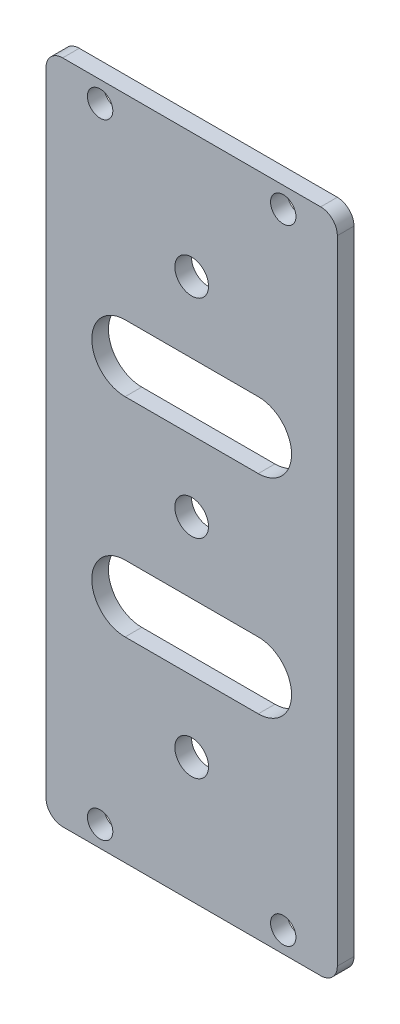
ISO-10303-21;
HEADER;
FILE_DESCRIPTION(('STEP AP214'),'2;1');
FILE_NAME('part.step','',(''),(''),'','','');
FILE_SCHEMA(('AUTOMOTIVE_DESIGN { 1 0 10303 214 1 1 1 1 }'));
ENDSEC;
DATA;
#1=APPLICATION_CONTEXT('core data for automotive mechanical design processes');
#2=APPLICATION_PROTOCOL_DEFINITION('international standard','automotive_design',2000,#1);
#3=PRODUCT_CONTEXT('',#1,'mechanical');
#4=PRODUCT('Part','Part','',(#3));
#5=PRODUCT_RELATED_PRODUCT_CATEGORY('part','',(#4));
#6=PRODUCT_DEFINITION_FORMATION('','',#4);
#7=PRODUCT_DEFINITION_CONTEXT('part definition',#1,'design');
#8=PRODUCT_DEFINITION('design','',#6,#7);
#9=PRODUCT_DEFINITION_SHAPE('','',#8);
#10=(LENGTH_UNIT() NAMED_UNIT(*) SI_UNIT(.MILLI.,.METRE.));
#11=(NAMED_UNIT(*) PLANE_ANGLE_UNIT() SI_UNIT($,.RADIAN.));
#12=(NAMED_UNIT(*) SI_UNIT($,.STERADIAN.) SOLID_ANGLE_UNIT());
#13=UNCERTAINTY_MEASURE_WITH_UNIT(LENGTH_MEASURE(1.E-05),#10,'distance_accuracy_value','');
#14=(GEOMETRIC_REPRESENTATION_CONTEXT(3) GLOBAL_UNCERTAINTY_ASSIGNED_CONTEXT((#13)) GLOBAL_UNIT_ASSIGNED_CONTEXT((#10,
#11,#12)) REPRESENTATION_CONTEXT('',''));
#15=CARTESIAN_POINT('',(0.,0.,0.));
#16=DIRECTION('',(0.,0.,1.));
#17=DIRECTION('',(1.,0.,0.));
#18=AXIS2_PLACEMENT_3D('',#15,#16,#17);
#19=CARTESIAN_POINT('',(17.5,-40.,2.));
#20=DIRECTION('',(-1.,0.,0.));
#21=DIRECTION('',(0.,0.,1.));
#22=AXIS2_PLACEMENT_3D('',#19,#20,#21);
#23=PLANE('',#22);
#24=DIRECTION('',(0.,1.,0.));
#25=VECTOR('',#24,1.);
#26=CARTESIAN_POINT('',(17.5,-40.,2.));
#27=LINE('',#26,#25);
#28=CARTESIAN_POINT('',(17.5,-38.,2.));
#29=VERTEX_POINT('',#28);
#30=CARTESIAN_POINT('',(17.5,38.,2.));
#31=VERTEX_POINT('',#30);
#32=EDGE_CURVE('E256',#29,#31,#27,.T.);
#33=ORIENTED_EDGE('',*,*,#32,.F.);
#34=DIRECTION('',(0.,0.,-1.));
#35=VECTOR('',#34,1.);
#36=CARTESIAN_POINT('',(17.5,-38.,2.));
#37=LINE('',#36,#35);
#38=CARTESIAN_POINT('',(17.5,-38.,0.));
#39=VERTEX_POINT('',#38);
#40=EDGE_CURVE('E281',#29,#39,#37,.T.);
#41=ORIENTED_EDGE('',*,*,#40,.T.);
#42=DIRECTION('',(0.,1.,0.));
#43=VECTOR('',#42,1.);
#44=CARTESIAN_POINT('',(17.5,-40.,0.));
#45=LINE('',#44,#43);
#46=CARTESIAN_POINT('',(17.5,38.,0.));
#47=VERTEX_POINT('',#46);
#48=EDGE_CURVE('E253',#39,#47,#45,.T.);
#49=ORIENTED_EDGE('',*,*,#48,.T.);
#50=DIRECTION('',(0.,0.,-1.));
#51=VECTOR('',#50,1.);
#52=CARTESIAN_POINT('',(17.5,38.,2.));
#53=LINE('',#52,#51);
#54=EDGE_CURVE('E269',#47,#31,#53,.F.);
#55=ORIENTED_EDGE('',*,*,#54,.T.);
#56=EDGE_LOOP('',(#33,#41,#49,#55));
#57=FACE_BOUND('',#56,.T.);
#58=ADVANCED_FACE('F37',(#57),#23,.F.);
#59=CARTESIAN_POINT('',(-17.5,40.,2.));
#60=DIRECTION('',(0.,-1.,0.));
#61=DIRECTION('',(0.,0.,-1.));
#62=AXIS2_PLACEMENT_3D('',#59,#60,#61);
#63=PLANE('',#62);
#64=DIRECTION('',(-1.,0.,0.));
#65=VECTOR('',#64,1.);
#66=CARTESIAN_POINT('',(-17.5,40.,2.));
#67=LINE('',#66,#65);
#68=CARTESIAN_POINT('',(15.5,40.,2.));
#69=VERTEX_POINT('',#68);
#70=CARTESIAN_POINT('',(-15.5,40.,2.));
#71=VERTEX_POINT('',#70);
#72=EDGE_CURVE('E259',#69,#71,#67,.T.);
#73=ORIENTED_EDGE('',*,*,#72,.F.);
#74=DIRECTION('',(0.,0.,-1.));
#75=VECTOR('',#74,1.);
#76=CARTESIAN_POINT('',(15.5,40.,2.));
#77=LINE('',#76,#75);
#78=CARTESIAN_POINT('',(15.5,40.,0.));
#79=VERTEX_POINT('',#78);
#80=EDGE_CURVE('E11',#69,#79,#77,.T.);
#81=ORIENTED_EDGE('',*,*,#80,.T.);
#82=DIRECTION('',(-1.,0.,0.));
#83=VECTOR('',#82,1.);
#84=CARTESIAN_POINT('',(-17.5,40.,0.));
#85=LINE('',#84,#83);
#86=CARTESIAN_POINT('',(-15.5,40.,0.));
#87=VERTEX_POINT('',#86);
#88=EDGE_CURVE('E272',#79,#87,#85,.T.);
#89=ORIENTED_EDGE('',*,*,#88,.T.);
#90=DIRECTION('',(0.,0.,-1.));
#91=VECTOR('',#90,1.);
#92=CARTESIAN_POINT('',(-15.5,40.,2.));
#93=LINE('',#92,#91);
#94=EDGE_CURVE('E46',#87,#71,#93,.F.);
#95=ORIENTED_EDGE('',*,*,#94,.T.);
#96=EDGE_LOOP('',(#73,#81,#89,#95));
#97=FACE_BOUND('',#96,.T.);
#98=ADVANCED_FACE('F353',(#97),#63,.F.);
#99=CARTESIAN_POINT('',(-17.5,-40.,2.));
#100=DIRECTION('',(1.,0.,0.));
#101=DIRECTION('',(0.,0.,-1.));
#102=AXIS2_PLACEMENT_3D('',#99,#100,#101);
#103=PLANE('',#102);
#104=DIRECTION('',(0.,-1.,0.));
#105=VECTOR('',#104,1.);
#106=CARTESIAN_POINT('',(-17.5,-40.,0.));
#107=LINE('',#106,#105);
#108=CARTESIAN_POINT('',(-17.5,38.,0.));
#109=VERTEX_POINT('',#108);
#110=CARTESIAN_POINT('',(-17.5,-38.,0.));
#111=VERTEX_POINT('',#110);
#112=EDGE_CURVE('E275',#109,#111,#107,.T.);
#113=ORIENTED_EDGE('',*,*,#112,.T.);
#114=DIRECTION('',(0.,0.,-1.));
#115=VECTOR('',#114,1.);
#116=CARTESIAN_POINT('',(-17.5,-38.,2.));
#117=LINE('',#116,#115);
#118=CARTESIAN_POINT('',(-17.5,-38.,2.));
#119=VERTEX_POINT('',#118);
#120=EDGE_CURVE('E308',#111,#119,#117,.F.);
#121=ORIENTED_EDGE('',*,*,#120,.T.);
#122=DIRECTION('',(0.,-1.,0.));
#123=VECTOR('',#122,1.);
#124=CARTESIAN_POINT('',(-17.5,-40.,2.));
#125=LINE('',#124,#123);
#126=CARTESIAN_POINT('',(-17.5,38.,2.));
#127=VERTEX_POINT('',#126);
#128=EDGE_CURVE('E263',#127,#119,#125,.T.);
#129=ORIENTED_EDGE('',*,*,#128,.F.);
#130=DIRECTION('',(0.,0.,-1.));
#131=VECTOR('',#130,1.);
#132=CARTESIAN_POINT('',(-17.5,38.,2.));
#133=LINE('',#132,#131);
#134=EDGE_CURVE('E305',#127,#109,#133,.T.);
#135=ORIENTED_EDGE('',*,*,#134,.T.);
#136=EDGE_LOOP('',(#113,#121,#129,#135));
#137=FACE_BOUND('',#136,.T.);
#138=ADVANCED_FACE('F360',(#137),#103,.F.);
#139=CARTESIAN_POINT('',(-17.5,-40.,2.));
#140=DIRECTION('',(0.,1.,0.));
#141=DIRECTION('',(0.,0.,1.));
#142=AXIS2_PLACEMENT_3D('',#139,#140,#141);
#143=PLANE('',#142);
#144=DIRECTION('',(1.,0.,0.));
#145=VECTOR('',#144,1.);
#146=CARTESIAN_POINT('',(-17.5,-40.,0.));
#147=LINE('',#146,#145);
#148=CARTESIAN_POINT('',(-15.5,-40.,0.));
#149=VERTEX_POINT('',#148);
#150=CARTESIAN_POINT('',(15.5,-40.,0.));
#151=VERTEX_POINT('',#150);
#152=EDGE_CURVE('E260',#149,#151,#147,.T.);
#153=ORIENTED_EDGE('',*,*,#152,.T.);
#154=DIRECTION('',(0.,0.,-1.));
#155=VECTOR('',#154,1.);
#156=CARTESIAN_POINT('',(15.5,-40.,2.));
#157=LINE('',#156,#155);
#158=CARTESIAN_POINT('',(15.5,-40.,2.));
#159=VERTEX_POINT('',#158);
#160=EDGE_CURVE('E295',#151,#159,#157,.F.);
#161=ORIENTED_EDGE('',*,*,#160,.T.);
#162=DIRECTION('',(1.,0.,0.));
#163=VECTOR('',#162,1.);
#164=CARTESIAN_POINT('',(-17.5,-40.,2.));
#165=LINE('',#164,#163);
#166=CARTESIAN_POINT('',(-15.5,-40.,2.));
#167=VERTEX_POINT('',#166);
#168=EDGE_CURVE('E266',#167,#159,#165,.T.);
#169=ORIENTED_EDGE('',*,*,#168,.F.);
#170=DIRECTION('',(0.,0.,-1.));
#171=VECTOR('',#170,1.);
#172=CARTESIAN_POINT('',(-15.5,-40.,2.));
#173=LINE('',#172,#171);
#174=EDGE_CURVE('E292',#167,#149,#173,.T.);
#175=ORIENTED_EDGE('',*,*,#174,.T.);
#176=EDGE_LOOP('',(#153,#161,#169,#175));
#177=FACE_BOUND('',#176,.T.);
#178=ADVANCED_FACE('F369',(#177),#143,.F.);
#179=CARTESIAN_POINT('',(0.,0.,2.));
#180=DIRECTION('',(0.,0.,-1.));
#181=DIRECTION('',(-1.,0.,0.));
#182=AXIS2_PLACEMENT_3D('',#179,#180,#181);
#183=PLANE('',#182);
#184=DIRECTION('',(1.,0.,0.));
#185=VECTOR('',#184,1.);
#186=CARTESIAN_POINT('',(-8.,8.5,2.));
#187=LINE('',#186,#185);
#188=CARTESIAN_POINT('',(-8.,8.5,2.));
#189=VERTEX_POINT('',#188);
#190=CARTESIAN_POINT('',(8.,8.5,2.));
#191=VERTEX_POINT('',#190);
#192=EDGE_CURVE('E182',#189,#191,#187,.T.);
#193=ORIENTED_EDGE('',*,*,#192,.F.);
#194=CARTESIAN_POINT('',(-8.,12.5,2.));
#195=DIRECTION('',(0.,0.,1.));
#196=DIRECTION('',(1.,0.,0.));
#197=AXIS2_PLACEMENT_3D('',#194,#195,#196);
#198=CIRCLE('',#197,4.);
#199=CARTESIAN_POINT('',(-8.,16.5,2.));
#200=VERTEX_POINT('',#199);
#201=EDGE_CURVE('E54',#200,#189,#198,.T.);
#202=ORIENTED_EDGE('',*,*,#201,.F.);
#203=DIRECTION('',(-1.,0.,0.));
#204=VECTOR('',#203,1.);
#205=CARTESIAN_POINT('',(-8.,16.5,2.));
#206=LINE('',#205,#204);
#207=CARTESIAN_POINT('',(8.,16.5,2.));
#208=VERTEX_POINT('',#207);
#209=EDGE_CURVE('E173',#208,#200,#206,.T.);
#210=ORIENTED_EDGE('',*,*,#209,.F.);
#211=CARTESIAN_POINT('',(8.,12.5,2.));
#212=DIRECTION('',(0.,0.,1.));
#213=DIRECTION('',(1.,0.,0.));
#214=AXIS2_PLACEMENT_3D('',#211,#212,#213);
#215=CIRCLE('',#214,4.);
#216=EDGE_CURVE('E176',#191,#208,#215,.T.);
#217=ORIENTED_EDGE('',*,*,#216,.F.);
#218=EDGE_LOOP('',(#193,#202,#210,#217));
#219=FACE_BOUND('',#218,.T.);
#220=DIRECTION('',(1.,0.,0.));
#221=VECTOR('',#220,1.);
#222=CARTESIAN_POINT('',(-8.,-16.5,2.));
#223=LINE('',#222,#221);
#224=CARTESIAN_POINT('',(-8.,-16.5,2.));
#225=VERTEX_POINT('',#224);
#226=CARTESIAN_POINT('',(8.,-16.5,2.));
#227=VERTEX_POINT('',#226);
#228=EDGE_CURVE('E208',#225,#227,#223,.T.);
#229=ORIENTED_EDGE('',*,*,#228,.F.);
#230=CARTESIAN_POINT('',(-8.00000000000001,-12.5,2.));
#231=DIRECTION('',(0.,0.,1.));
#232=DIRECTION('',(-1.,0.,0.));
#233=AXIS2_PLACEMENT_3D('',#230,#231,#232);
#234=CIRCLE('',#233,4.);
#235=CARTESIAN_POINT('',(-8.,-8.5,2.));
#236=VERTEX_POINT('',#235);
#237=EDGE_CURVE('E62',#236,#225,#234,.T.);
#238=ORIENTED_EDGE('',*,*,#237,.F.);
#239=DIRECTION('',(-1.,0.,0.));
#240=VECTOR('',#239,1.);
#241=CARTESIAN_POINT('',(-8.,-8.5,2.));
#242=LINE('',#241,#240);
#243=CARTESIAN_POINT('',(8.,-8.50000000000001,2.));
#244=VERTEX_POINT('',#243);
#245=EDGE_CURVE('E197',#244,#236,#242,.T.);
#246=ORIENTED_EDGE('',*,*,#245,.F.);
#247=CARTESIAN_POINT('',(7.99999999999999,-12.5,2.));
#248=DIRECTION('',(0.,0.,1.));
#249=DIRECTION('',(-1.,0.,0.));
#250=AXIS2_PLACEMENT_3D('',#247,#248,#249);
#251=CIRCLE('',#250,4.);
#252=EDGE_CURVE('E211',#227,#244,#251,.T.);
#253=ORIENTED_EDGE('',*,*,#252,.F.);
#254=EDGE_LOOP('',(#229,#238,#246,#253));
#255=FACE_BOUND('',#254,.T.);
#256=CARTESIAN_POINT('',(0.,25.,2.));
#257=DIRECTION('',(0.,0.,1.));
#258=DIRECTION('',(1.,0.,0.));
#259=AXIS2_PLACEMENT_3D('',#256,#257,#258);
#260=CIRCLE('',#259,2.025);
#261=CARTESIAN_POINT('',(2.025,25.,2.));
#262=VERTEX_POINT('',#261);
#263=EDGE_CURVE('E222',#262,#262,#260,.T.);
#264=ORIENTED_EDGE('',*,*,#263,.F.);
#265=EDGE_LOOP('',(#264));
#266=FACE_BOUND('',#265,.T.);
#267=CARTESIAN_POINT('',(0.,0.,2.));
#268=DIRECTION('',(0.,0.,1.));
#269=DIRECTION('',(1.,0.,0.));
#270=AXIS2_PLACEMENT_3D('',#267,#268,#269);
#271=CIRCLE('',#270,2.025);
#272=CARTESIAN_POINT('',(2.025,0.,2.));
#273=VERTEX_POINT('',#272);
#274=EDGE_CURVE('E226',#273,#273,#271,.T.);
#275=ORIENTED_EDGE('',*,*,#274,.F.);
#276=EDGE_LOOP('',(#275));
#277=FACE_BOUND('',#276,.T.);
#278=CARTESIAN_POINT('',(0.,-25.,2.));
#279=DIRECTION('',(0.,0.,1.));
#280=DIRECTION('',(-1.,0.,0.));
#281=AXIS2_PLACEMENT_3D('',#278,#279,#280);
#282=CIRCLE('',#281,2.025);
#283=CARTESIAN_POINT('',(-2.025,-25.,2.));
#284=VERTEX_POINT('',#283);
#285=EDGE_CURVE('E189',#284,#284,#282,.T.);
#286=ORIENTED_EDGE('',*,*,#285,.F.);
#287=EDGE_LOOP('',(#286));
#288=FACE_BOUND('',#287,.T.);
#289=CARTESIAN_POINT('',(11.,-37.5,2.));
#290=DIRECTION('',(0.,0.,1.));
#291=DIRECTION('',(1.,0.,0.));
#292=AXIS2_PLACEMENT_3D('',#289,#290,#291);
#293=CIRCLE('',#292,1.525);
#294=CARTESIAN_POINT('',(12.525,-37.5,2.));
#295=VERTEX_POINT('',#294);
#296=EDGE_CURVE('E247',#295,#295,#293,.T.);
#297=ORIENTED_EDGE('',*,*,#296,.F.);
#298=EDGE_LOOP('',(#297));
#299=FACE_BOUND('',#298,.T.);
#300=CARTESIAN_POINT('',(-11.,-37.5,2.));
#301=DIRECTION('',(0.,0.,1.));
#302=DIRECTION('',(1.,0.,0.));
#303=AXIS2_PLACEMENT_3D('',#300,#301,#302);
#304=CIRCLE('',#303,1.525);
#305=CARTESIAN_POINT('',(-9.475,-37.5,2.));
#306=VERTEX_POINT('',#305);
#307=EDGE_CURVE('E241',#306,#306,#304,.T.);
#308=ORIENTED_EDGE('',*,*,#307,.F.);
#309=EDGE_LOOP('',(#308));
#310=FACE_BOUND('',#309,.T.);
#311=CARTESIAN_POINT('',(-11.,37.5,2.));
#312=DIRECTION('',(0.,0.,1.));
#313=DIRECTION('',(1.,0.,0.));
#314=AXIS2_PLACEMENT_3D('',#311,#312,#313);
#315=CIRCLE('',#314,1.525);
#316=CARTESIAN_POINT('',(-9.475,37.5,2.));
#317=VERTEX_POINT('',#316);
#318=EDGE_CURVE('E235',#317,#317,#315,.T.);
#319=ORIENTED_EDGE('',*,*,#318,.F.);
#320=EDGE_LOOP('',(#319));
#321=FACE_BOUND('',#320,.T.);
#322=CARTESIAN_POINT('',(11.,37.5,2.));
#323=DIRECTION('',(0.,0.,1.));
#324=DIRECTION('',(1.,0.,0.));
#325=AXIS2_PLACEMENT_3D('',#322,#323,#324);
#326=CIRCLE('',#325,1.525);
#327=CARTESIAN_POINT('',(12.525,37.5,2.));
#328=VERTEX_POINT('',#327);
#329=EDGE_CURVE('E234',#328,#328,#326,.T.);
#330=ORIENTED_EDGE('',*,*,#329,.F.);
#331=EDGE_LOOP('',(#330));
#332=FACE_BOUND('',#331,.T.);
#333=ORIENTED_EDGE('',*,*,#168,.T.);
#334=CARTESIAN_POINT('',(15.5,-38.,2.));
#335=DIRECTION('',(0.,0.,-1.));
#336=DIRECTION('',(-1.,0.,0.));
#337=AXIS2_PLACEMENT_3D('',#334,#335,#336);
#338=CIRCLE('',#337,2.);
#339=EDGE_CURVE('E303',#159,#29,#338,.F.);
#340=ORIENTED_EDGE('',*,*,#339,.T.);
#341=ORIENTED_EDGE('',*,*,#32,.T.);
#342=CARTESIAN_POINT('',(15.5,38.,2.));
#343=DIRECTION('',(0.,0.,-1.));
#344=DIRECTION('',(-1.,0.,0.));
#345=AXIS2_PLACEMENT_3D('',#342,#343,#344);
#346=CIRCLE('',#345,2.);
#347=EDGE_CURVE('E299',#31,#69,#346,.F.);
#348=ORIENTED_EDGE('',*,*,#347,.T.);
#349=ORIENTED_EDGE('',*,*,#72,.T.);
#350=CARTESIAN_POINT('',(-15.5,38.,2.));
#351=DIRECTION('',(0.,0.,-1.));
#352=DIRECTION('',(-1.,0.,0.));
#353=AXIS2_PLACEMENT_3D('',#350,#351,#352);
#354=CIRCLE('',#353,2.);
#355=EDGE_CURVE('E297',#71,#127,#354,.F.);
#356=ORIENTED_EDGE('',*,*,#355,.T.);
#357=ORIENTED_EDGE('',*,*,#128,.T.);
#358=CARTESIAN_POINT('',(-15.5,-38.,2.));
#359=DIRECTION('',(0.,0.,-1.));
#360=DIRECTION('',(-1.,0.,0.));
#361=AXIS2_PLACEMENT_3D('',#358,#359,#360);
#362=CIRCLE('',#361,2.);
#363=EDGE_CURVE('E301',#119,#167,#362,.F.);
#364=ORIENTED_EDGE('',*,*,#363,.T.);
#365=EDGE_LOOP('',(#333,#340,#341,#348,#349,#356,#357,#364));
#366=FACE_BOUND('',#365,.T.);
#367=ADVANCED_FACE('F325',(#219,#255,#266,#277,#288,#299,#310,#321,#332,#366),#183,.F.);
#368=CARTESIAN_POINT('',(0.,0.,0.));
#369=DIRECTION('',(0.,0.,-1.));
#370=DIRECTION('',(-1.,0.,0.));
#371=AXIS2_PLACEMENT_3D('',#368,#369,#370);
#372=PLANE('',#371);
#373=CARTESIAN_POINT('',(-8.,12.5,0.));
#374=DIRECTION('',(0.,0.,1.));
#375=DIRECTION('',(1.,0.,0.));
#376=AXIS2_PLACEMENT_3D('',#373,#374,#375);
#377=CIRCLE('',#376,4.);
#378=CARTESIAN_POINT('',(-8.,16.5,0.));
#379=VERTEX_POINT('',#378);
#380=CARTESIAN_POINT('',(-8.,8.5,0.));
#381=VERTEX_POINT('',#380);
#382=EDGE_CURVE('E154',#379,#381,#377,.T.);
#383=ORIENTED_EDGE('',*,*,#382,.T.);
#384=DIRECTION('',(1.,0.,0.));
#385=VECTOR('',#384,1.);
#386=CARTESIAN_POINT('',(-8.,8.5,0.));
#387=LINE('',#386,#385);
#388=CARTESIAN_POINT('',(8.,8.5,0.));
#389=VERTEX_POINT('',#388);
#390=EDGE_CURVE('E164',#381,#389,#387,.T.);
#391=ORIENTED_EDGE('',*,*,#390,.T.);
#392=CARTESIAN_POINT('',(8.,12.5,0.));
#393=DIRECTION('',(0.,0.,1.));
#394=DIRECTION('',(1.,0.,0.));
#395=AXIS2_PLACEMENT_3D('',#392,#393,#394);
#396=CIRCLE('',#395,4.);
#397=CARTESIAN_POINT('',(8.,16.5,0.));
#398=VERTEX_POINT('',#397);
#399=EDGE_CURVE('E168',#389,#398,#396,.T.);
#400=ORIENTED_EDGE('',*,*,#399,.T.);
#401=DIRECTION('',(-1.,0.,0.));
#402=VECTOR('',#401,1.);
#403=CARTESIAN_POINT('',(-8.,16.5,0.));
#404=LINE('',#403,#402);
#405=EDGE_CURVE('E160',#398,#379,#404,.T.);
#406=ORIENTED_EDGE('',*,*,#405,.T.);
#407=EDGE_LOOP('',(#383,#391,#400,#406));
#408=FACE_BOUND('',#407,.T.);
#409=CARTESIAN_POINT('',(-8.00000000000001,-12.5,0.));
#410=DIRECTION('',(0.,0.,1.));
#411=DIRECTION('',(-1.,0.,0.));
#412=AXIS2_PLACEMENT_3D('',#409,#410,#411);
#413=CIRCLE('',#412,4.);
#414=CARTESIAN_POINT('',(-8.,-8.5,0.));
#415=VERTEX_POINT('',#414);
#416=CARTESIAN_POINT('',(-8.,-16.5,0.));
#417=VERTEX_POINT('',#416);
#418=EDGE_CURVE('E193',#415,#417,#413,.T.);
#419=ORIENTED_EDGE('',*,*,#418,.T.);
#420=DIRECTION('',(1.,0.,0.));
#421=VECTOR('',#420,1.);
#422=CARTESIAN_POINT('',(-8.,-16.5,0.));
#423=LINE('',#422,#421);
#424=CARTESIAN_POINT('',(8.,-16.5,0.));
#425=VERTEX_POINT('',#424);
#426=EDGE_CURVE('E196',#417,#425,#423,.T.);
#427=ORIENTED_EDGE('',*,*,#426,.T.);
#428=CARTESIAN_POINT('',(7.99999999999999,-12.5,0.));
#429=DIRECTION('',(0.,0.,1.));
#430=DIRECTION('',(-1.,0.,0.));
#431=AXIS2_PLACEMENT_3D('',#428,#429,#430);
#432=CIRCLE('',#431,4.);
#433=CARTESIAN_POINT('',(8.,-8.50000000000001,0.));
#434=VERTEX_POINT('',#433);
#435=EDGE_CURVE('E200',#425,#434,#432,.T.);
#436=ORIENTED_EDGE('',*,*,#435,.T.);
#437=DIRECTION('',(-1.,0.,0.));
#438=VECTOR('',#437,1.);
#439=CARTESIAN_POINT('',(-8.,-8.5,0.));
#440=LINE('',#439,#438);
#441=EDGE_CURVE('E203',#434,#415,#440,.T.);
#442=ORIENTED_EDGE('',*,*,#441,.T.);
#443=EDGE_LOOP('',(#419,#427,#436,#442));
#444=FACE_BOUND('',#443,.T.);
#445=CARTESIAN_POINT('',(0.,25.,0.));
#446=DIRECTION('',(0.,0.,-1.));
#447=DIRECTION('',(-1.,0.,0.));
#448=AXIS2_PLACEMENT_3D('',#445,#446,#447);
#449=CIRCLE('',#448,2.025);
#450=CARTESIAN_POINT('',(-2.025,25.,0.));
#451=VERTEX_POINT('',#450);
#452=EDGE_CURVE('E41',#451,#451,#449,.T.);
#453=ORIENTED_EDGE('',*,*,#452,.F.);
#454=EDGE_LOOP('',(#453));
#455=FACE_BOUND('',#454,.T.);
#456=CARTESIAN_POINT('',(0.,0.,0.));
#457=DIRECTION('',(0.,0.,-1.));
#458=DIRECTION('',(-1.,0.,0.));
#459=AXIS2_PLACEMENT_3D('',#456,#457,#458);
#460=CIRCLE('',#459,2.025);
#461=CARTESIAN_POINT('',(-2.025,0.,0.));
#462=VERTEX_POINT('',#461);
#463=EDGE_CURVE('E312',#462,#462,#460,.T.);
#464=ORIENTED_EDGE('',*,*,#463,.F.);
#465=EDGE_LOOP('',(#464));
#466=FACE_BOUND('',#465,.T.);
#467=CARTESIAN_POINT('',(0.,-25.,0.));
#468=DIRECTION('',(0.,0.,-1.));
#469=DIRECTION('',(-1.,0.,0.));
#470=AXIS2_PLACEMENT_3D('',#467,#468,#469);
#471=CIRCLE('',#470,2.025);
#472=CARTESIAN_POINT('',(-2.025,-25.,0.));
#473=VERTEX_POINT('',#472);
#474=EDGE_CURVE('E225',#473,#473,#471,.T.);
#475=ORIENTED_EDGE('',*,*,#474,.F.);
#476=EDGE_LOOP('',(#475));
#477=FACE_BOUND('',#476,.T.);
#478=CARTESIAN_POINT('',(11.,-37.5,0.));
#479=DIRECTION('',(0.,0.,1.));
#480=DIRECTION('',(1.,0.,0.));
#481=AXIS2_PLACEMENT_3D('',#478,#479,#480);
#482=CIRCLE('',#481,1.525);
#483=CARTESIAN_POINT('',(12.525,-37.5,0.));
#484=VERTEX_POINT('',#483);
#485=EDGE_CURVE('E244',#484,#484,#482,.T.);
#486=ORIENTED_EDGE('',*,*,#485,.T.);
#487=EDGE_LOOP('',(#486));
#488=FACE_BOUND('',#487,.T.);
#489=CARTESIAN_POINT('',(-11.,-37.5,0.));
#490=DIRECTION('',(0.,0.,1.));
#491=DIRECTION('',(1.,0.,0.));
#492=AXIS2_PLACEMENT_3D('',#489,#490,#491);
#493=CIRCLE('',#492,1.525);
#494=CARTESIAN_POINT('',(-9.475,-37.5,0.));
#495=VERTEX_POINT('',#494);
#496=EDGE_CURVE('E238',#495,#495,#493,.T.);
#497=ORIENTED_EDGE('',*,*,#496,.T.);
#498=EDGE_LOOP('',(#497));
#499=FACE_BOUND('',#498,.T.);
#500=CARTESIAN_POINT('',(-11.,37.5,0.));
#501=DIRECTION('',(0.,0.,1.));
#502=DIRECTION('',(1.,0.,0.));
#503=AXIS2_PLACEMENT_3D('',#500,#501,#502);
#504=CIRCLE('',#503,1.525);
#505=CARTESIAN_POINT('',(-9.475,37.5,0.));
#506=VERTEX_POINT('',#505);
#507=EDGE_CURVE('E231',#506,#506,#504,.T.);
#508=ORIENTED_EDGE('',*,*,#507,.T.);
#509=EDGE_LOOP('',(#508));
#510=FACE_BOUND('',#509,.T.);
#511=CARTESIAN_POINT('',(11.,37.5,0.));
#512=DIRECTION('',(0.,0.,1.));
#513=DIRECTION('',(1.,0.,0.));
#514=AXIS2_PLACEMENT_3D('',#511,#512,#513);
#515=CIRCLE('',#514,1.525);
#516=CARTESIAN_POINT('',(12.525,37.5,0.));
#517=VERTEX_POINT('',#516);
#518=EDGE_CURVE('E250',#517,#517,#515,.T.);
#519=ORIENTED_EDGE('',*,*,#518,.T.);
#520=EDGE_LOOP('',(#519));
#521=FACE_BOUND('',#520,.T.);
#522=ORIENTED_EDGE('',*,*,#48,.F.);
#523=CARTESIAN_POINT('',(15.5,-38.,0.));
#524=DIRECTION('',(0.,0.,-1.));
#525=DIRECTION('',(-1.,0.,0.));
#526=AXIS2_PLACEMENT_3D('',#523,#524,#525);
#527=CIRCLE('',#526,2.);
#528=EDGE_CURVE('E290',#39,#151,#527,.T.);
#529=ORIENTED_EDGE('',*,*,#528,.T.);
#530=ORIENTED_EDGE('',*,*,#152,.F.);
#531=CARTESIAN_POINT('',(-15.5,-38.,0.));
#532=DIRECTION('',(0.,0.,-1.));
#533=DIRECTION('',(-1.,0.,0.));
#534=AXIS2_PLACEMENT_3D('',#531,#532,#533);
#535=CIRCLE('',#534,2.);
#536=EDGE_CURVE('E288',#149,#111,#535,.T.);
#537=ORIENTED_EDGE('',*,*,#536,.T.);
#538=ORIENTED_EDGE('',*,*,#112,.F.);
#539=CARTESIAN_POINT('',(-15.5,38.,0.));
#540=DIRECTION('',(0.,0.,-1.));
#541=DIRECTION('',(-1.,0.,0.));
#542=AXIS2_PLACEMENT_3D('',#539,#540,#541);
#543=CIRCLE('',#542,2.);
#544=EDGE_CURVE('E284',#109,#87,#543,.T.);
#545=ORIENTED_EDGE('',*,*,#544,.T.);
#546=ORIENTED_EDGE('',*,*,#88,.F.);
#547=CARTESIAN_POINT('',(15.5,38.,0.));
#548=DIRECTION('',(0.,0.,-1.));
#549=DIRECTION('',(-1.,0.,0.));
#550=AXIS2_PLACEMENT_3D('',#547,#548,#549);
#551=CIRCLE('',#550,2.);
#552=EDGE_CURVE('E286',#79,#47,#551,.T.);
#553=ORIENTED_EDGE('',*,*,#552,.T.);
#554=EDGE_LOOP('',(#522,#529,#530,#537,#538,#545,#546,#553));
#555=FACE_BOUND('',#554,.T.);
#556=ADVANCED_FACE('F170',(#408,#444,#455,#466,#477,#488,#499,#510,#521,#555),#372,.T.);
#557=CARTESIAN_POINT('',(11.,37.5,0.));
#558=DIRECTION('',(0.,0.,1.));
#559=DIRECTION('',(1.,0.,0.));
#560=AXIS2_PLACEMENT_3D('',#557,#558,#559);
#561=CYLINDRICAL_SURFACE('',#560,1.525);
#562=ORIENTED_EDGE('',*,*,#518,.F.);
#563=EDGE_LOOP('',(#562));
#564=FACE_BOUND('',#563,.T.);
#565=ORIENTED_EDGE('',*,*,#329,.T.);
#566=EDGE_LOOP('',(#565));
#567=FACE_BOUND('',#566,.T.);
#568=ADVANCED_FACE('F324',(#564,#567),#561,.F.);
#569=CARTESIAN_POINT('',(-11.,37.5,0.));
#570=DIRECTION('',(0.,0.,1.));
#571=DIRECTION('',(1.,0.,0.));
#572=AXIS2_PLACEMENT_3D('',#569,#570,#571);
#573=CYLINDRICAL_SURFACE('',#572,1.525);
#574=ORIENTED_EDGE('',*,*,#507,.F.);
#575=EDGE_LOOP('',(#574));
#576=FACE_BOUND('',#575,.T.);
#577=ORIENTED_EDGE('',*,*,#318,.T.);
#578=EDGE_LOOP('',(#577));
#579=FACE_BOUND('',#578,.T.);
#580=ADVANCED_FACE('F399',(#576,#579),#573,.F.);
#581=CARTESIAN_POINT('',(-11.,-37.5,0.));
#582=DIRECTION('',(0.,0.,1.));
#583=DIRECTION('',(1.,0.,0.));
#584=AXIS2_PLACEMENT_3D('',#581,#582,#583);
#585=CYLINDRICAL_SURFACE('',#584,1.525);
#586=ORIENTED_EDGE('',*,*,#496,.F.);
#587=EDGE_LOOP('',(#586));
#588=FACE_BOUND('',#587,.T.);
#589=ORIENTED_EDGE('',*,*,#307,.T.);
#590=EDGE_LOOP('',(#589));
#591=FACE_BOUND('',#590,.T.);
#592=ADVANCED_FACE('F381',(#588,#591),#585,.F.);
#593=CARTESIAN_POINT('',(11.,-37.5,0.));
#594=DIRECTION('',(0.,0.,1.));
#595=DIRECTION('',(1.,0.,0.));
#596=AXIS2_PLACEMENT_3D('',#593,#594,#595);
#597=CYLINDRICAL_SURFACE('',#596,1.525);
#598=ORIENTED_EDGE('',*,*,#485,.F.);
#599=EDGE_LOOP('',(#598));
#600=FACE_BOUND('',#599,.T.);
#601=ORIENTED_EDGE('',*,*,#296,.T.);
#602=EDGE_LOOP('',(#601));
#603=FACE_BOUND('',#602,.T.);
#604=ADVANCED_FACE('F374',(#600,#603),#597,.F.);
#605=CARTESIAN_POINT('',(15.5,-38.,2.));
#606=DIRECTION('',(0.,0.,-1.));
#607=DIRECTION('',(-1.,0.,0.));
#608=AXIS2_PLACEMENT_3D('',#605,#606,#607);
#609=CYLINDRICAL_SURFACE('',#608,2.);
#610=ORIENTED_EDGE('',*,*,#339,.F.);
#611=ORIENTED_EDGE('',*,*,#160,.F.);
#612=ORIENTED_EDGE('',*,*,#528,.F.);
#613=ORIENTED_EDGE('',*,*,#40,.F.);
#614=EDGE_LOOP('',(#610,#611,#612,#613));
#615=FACE_BOUND('',#614,.T.);
#616=ADVANCED_FACE('F372',(#615),#609,.T.);
#617=CARTESIAN_POINT('',(-15.5,-38.,2.));
#618=DIRECTION('',(0.,0.,-1.));
#619=DIRECTION('',(-1.,0.,0.));
#620=AXIS2_PLACEMENT_3D('',#617,#618,#619);
#621=CYLINDRICAL_SURFACE('',#620,2.);
#622=ORIENTED_EDGE('',*,*,#363,.F.);
#623=ORIENTED_EDGE('',*,*,#120,.F.);
#624=ORIENTED_EDGE('',*,*,#536,.F.);
#625=ORIENTED_EDGE('',*,*,#174,.F.);
#626=EDGE_LOOP('',(#622,#623,#624,#625));
#627=FACE_BOUND('',#626,.T.);
#628=ADVANCED_FACE('F364',(#627),#621,.T.);
#629=CARTESIAN_POINT('',(15.5,38.,2.));
#630=DIRECTION('',(0.,0.,-1.));
#631=DIRECTION('',(-1.,0.,0.));
#632=AXIS2_PLACEMENT_3D('',#629,#630,#631);
#633=CYLINDRICAL_SURFACE('',#632,2.);
#634=ORIENTED_EDGE('',*,*,#347,.F.);
#635=ORIENTED_EDGE('',*,*,#54,.F.);
#636=ORIENTED_EDGE('',*,*,#552,.F.);
#637=ORIENTED_EDGE('',*,*,#80,.F.);
#638=EDGE_LOOP('',(#634,#635,#636,#637));
#639=FACE_BOUND('',#638,.T.);
#640=ADVANCED_FACE('F347',(#639),#633,.T.);
#641=CARTESIAN_POINT('',(-15.5,38.,2.));
#642=DIRECTION('',(0.,0.,-1.));
#643=DIRECTION('',(-1.,0.,0.));
#644=AXIS2_PLACEMENT_3D('',#641,#642,#643);
#645=CYLINDRICAL_SURFACE('',#644,2.);
#646=ORIENTED_EDGE('',*,*,#355,.F.);
#647=ORIENTED_EDGE('',*,*,#94,.F.);
#648=ORIENTED_EDGE('',*,*,#544,.F.);
#649=ORIENTED_EDGE('',*,*,#134,.F.);
#650=EDGE_LOOP('',(#646,#647,#648,#649));
#651=FACE_BOUND('',#650,.T.);
#652=ADVANCED_FACE('F39',(#651),#645,.T.);
#653=CARTESIAN_POINT('',(0.,-25.,-8.));
#654=DIRECTION('',(0.,0.,1.));
#655=DIRECTION('',(1.,0.,0.));
#656=AXIS2_PLACEMENT_3D('',#653,#654,#655);
#657=CYLINDRICAL_SURFACE('',#656,2.025);
#658=ORIENTED_EDGE('',*,*,#474,.T.);
#659=EDGE_LOOP('',(#658));
#660=FACE_BOUND('',#659,.T.);
#661=ORIENTED_EDGE('',*,*,#285,.T.);
#662=EDGE_LOOP('',(#661));
#663=FACE_BOUND('',#662,.T.);
#664=ADVANCED_FACE('F408',(#660,#663),#657,.F.);
#665=CARTESIAN_POINT('',(0.,0.,-8.));
#666=DIRECTION('',(0.,0.,1.));
#667=DIRECTION('',(1.,0.,0.));
#668=AXIS2_PLACEMENT_3D('',#665,#666,#667);
#669=CYLINDRICAL_SURFACE('',#668,2.025);
#670=ORIENTED_EDGE('',*,*,#463,.T.);
#671=EDGE_LOOP('',(#670));
#672=FACE_BOUND('',#671,.T.);
#673=ORIENTED_EDGE('',*,*,#274,.T.);
#674=EDGE_LOOP('',(#673));
#675=FACE_BOUND('',#674,.T.);
#676=ADVANCED_FACE('F411',(#672,#675),#669,.F.);
#677=CARTESIAN_POINT('',(0.,25.,-8.));
#678=DIRECTION('',(0.,0.,1.));
#679=DIRECTION('',(1.,0.,0.));
#680=AXIS2_PLACEMENT_3D('',#677,#678,#679);
#681=CYLINDRICAL_SURFACE('',#680,2.025);
#682=ORIENTED_EDGE('',*,*,#452,.T.);
#683=EDGE_LOOP('',(#682));
#684=FACE_BOUND('',#683,.T.);
#685=ORIENTED_EDGE('',*,*,#263,.T.);
#686=EDGE_LOOP('',(#685));
#687=FACE_BOUND('',#686,.T.);
#688=ADVANCED_FACE('F319',(#684,#687),#681,.F.);
#689=CARTESIAN_POINT('',(-8.00000000000001,-12.5,0.));
#690=DIRECTION('',(0.,0.,1.));
#691=DIRECTION('',(1.,0.,0.));
#692=AXIS2_PLACEMENT_3D('',#689,#690,#691);
#693=CYLINDRICAL_SURFACE('',#692,4.);
#694=ORIENTED_EDGE('',*,*,#237,.T.);
#695=DIRECTION('',(0.,0.,1.));
#696=VECTOR('',#695,1.);
#697=CARTESIAN_POINT('',(-8.,-16.5,0.));
#698=LINE('',#697,#696);
#699=EDGE_CURVE('E206',#417,#225,#698,.T.);
#700=ORIENTED_EDGE('',*,*,#699,.F.);
#701=ORIENTED_EDGE('',*,*,#418,.F.);
#702=DIRECTION('',(0.,0.,1.));
#703=VECTOR('',#702,1.);
#704=CARTESIAN_POINT('',(-8.,-8.5,0.));
#705=LINE('',#704,#703);
#706=EDGE_CURVE('E183',#415,#236,#705,.T.);
#707=ORIENTED_EDGE('',*,*,#706,.T.);
#708=EDGE_LOOP('',(#694,#700,#701,#707));
#709=FACE_BOUND('',#708,.T.);
#710=ADVANCED_FACE('F417',(#709),#693,.F.);
#711=CARTESIAN_POINT('',(-8.,-8.5,0.));
#712=DIRECTION('',(0.,1.,0.));
#713=DIRECTION('',(0.,0.,1.));
#714=AXIS2_PLACEMENT_3D('',#711,#712,#713);
#715=PLANE('',#714);
#716=ORIENTED_EDGE('',*,*,#245,.T.);
#717=ORIENTED_EDGE('',*,*,#706,.F.);
#718=ORIENTED_EDGE('',*,*,#441,.F.);
#719=DIRECTION('',(0.,0.,1.));
#720=VECTOR('',#719,1.);
#721=CARTESIAN_POINT('',(8.,-8.50000000000001,0.));
#722=LINE('',#721,#720);
#723=EDGE_CURVE('E217',#434,#244,#722,.T.);
#724=ORIENTED_EDGE('',*,*,#723,.T.);
#725=EDGE_LOOP('',(#716,#717,#718,#724));
#726=FACE_BOUND('',#725,.T.);
#727=ADVANCED_FACE('F420',(#726),#715,.F.);
#728=CARTESIAN_POINT('',(7.99999999999999,-12.5,0.));
#729=DIRECTION('',(0.,0.,1.));
#730=DIRECTION('',(1.,0.,0.));
#731=AXIS2_PLACEMENT_3D('',#728,#729,#730);
#732=CYLINDRICAL_SURFACE('',#731,4.);
#733=ORIENTED_EDGE('',*,*,#252,.T.);
#734=ORIENTED_EDGE('',*,*,#723,.F.);
#735=ORIENTED_EDGE('',*,*,#435,.F.);
#736=DIRECTION('',(0.,0.,1.));
#737=VECTOR('',#736,1.);
#738=CARTESIAN_POINT('',(8.,-16.5,0.));
#739=LINE('',#738,#737);
#740=EDGE_CURVE('E219',#425,#227,#739,.T.);
#741=ORIENTED_EDGE('',*,*,#740,.T.);
#742=EDGE_LOOP('',(#733,#734,#735,#741));
#743=FACE_BOUND('',#742,.T.);
#744=ADVANCED_FACE('F424',(#743),#732,.F.);
#745=CARTESIAN_POINT('',(-8.,-16.5,0.));
#746=DIRECTION('',(0.,-1.,0.));
#747=DIRECTION('',(0.,0.,-1.));
#748=AXIS2_PLACEMENT_3D('',#745,#746,#747);
#749=PLANE('',#748);
#750=ORIENTED_EDGE('',*,*,#228,.T.);
#751=ORIENTED_EDGE('',*,*,#740,.F.);
#752=ORIENTED_EDGE('',*,*,#426,.F.);
#753=ORIENTED_EDGE('',*,*,#699,.T.);
#754=EDGE_LOOP('',(#750,#751,#752,#753));
#755=FACE_BOUND('',#754,.T.);
#756=ADVANCED_FACE('F421',(#755),#749,.F.);
#757=CARTESIAN_POINT('',(-8.,12.5,0.));
#758=DIRECTION('',(0.,0.,1.));
#759=DIRECTION('',(1.,0.,0.));
#760=AXIS2_PLACEMENT_3D('',#757,#758,#759);
#761=CYLINDRICAL_SURFACE('',#760,4.);
#762=ORIENTED_EDGE('',*,*,#201,.T.);
#763=DIRECTION('',(0.,0.,1.));
#764=VECTOR('',#763,1.);
#765=CARTESIAN_POINT('',(-8.,8.5,0.));
#766=LINE('',#765,#764);
#767=EDGE_CURVE('E150',#381,#189,#766,.T.);
#768=ORIENTED_EDGE('',*,*,#767,.F.);
#769=ORIENTED_EDGE('',*,*,#382,.F.);
#770=DIRECTION('',(0.,0.,1.));
#771=VECTOR('',#770,1.);
#772=CARTESIAN_POINT('',(-8.,16.5,0.));
#773=LINE('',#772,#771);
#774=EDGE_CURVE('E187',#379,#200,#773,.T.);
#775=ORIENTED_EDGE('',*,*,#774,.T.);
#776=EDGE_LOOP('',(#762,#768,#769,#775));
#777=FACE_BOUND('',#776,.T.);
#778=ADVANCED_FACE('F152',(#777),#761,.F.);
#779=CARTESIAN_POINT('',(-8.,16.5,0.));
#780=DIRECTION('',(0.,1.,0.));
#781=DIRECTION('',(0.,0.,1.));
#782=AXIS2_PLACEMENT_3D('',#779,#780,#781);
#783=PLANE('',#782);
#784=ORIENTED_EDGE('',*,*,#209,.T.);
#785=ORIENTED_EDGE('',*,*,#774,.F.);
#786=ORIENTED_EDGE('',*,*,#405,.F.);
#787=DIRECTION('',(0.,0.,1.));
#788=VECTOR('',#787,1.);
#789=CARTESIAN_POINT('',(8.,16.5,0.));
#790=LINE('',#789,#788);
#791=EDGE_CURVE('E190',#398,#208,#790,.T.);
#792=ORIENTED_EDGE('',*,*,#791,.T.);
#793=EDGE_LOOP('',(#784,#785,#786,#792));
#794=FACE_BOUND('',#793,.T.);
#795=ADVANCED_FACE('F434',(#794),#783,.F.);
#796=CARTESIAN_POINT('',(8.,12.5,0.));
#797=DIRECTION('',(0.,0.,1.));
#798=DIRECTION('',(1.,0.,0.));
#799=AXIS2_PLACEMENT_3D('',#796,#797,#798);
#800=CYLINDRICAL_SURFACE('',#799,4.);
#801=ORIENTED_EDGE('',*,*,#216,.T.);
#802=ORIENTED_EDGE('',*,*,#791,.F.);
#803=ORIENTED_EDGE('',*,*,#399,.F.);
#804=DIRECTION('',(0.,0.,1.));
#805=VECTOR('',#804,1.);
#806=CARTESIAN_POINT('',(8.,8.5,0.));
#807=LINE('',#806,#805);
#808=EDGE_CURVE('E159',#389,#191,#807,.T.);
#809=ORIENTED_EDGE('',*,*,#808,.T.);
#810=EDGE_LOOP('',(#801,#802,#803,#809));
#811=FACE_BOUND('',#810,.T.);
#812=ADVANCED_FACE('F437',(#811),#800,.F.);
#813=CARTESIAN_POINT('',(-8.,8.5,0.));
#814=DIRECTION('',(0.,-1.,0.));
#815=DIRECTION('',(0.,0.,-1.));
#816=AXIS2_PLACEMENT_3D('',#813,#814,#815);
#817=PLANE('',#816);
#818=ORIENTED_EDGE('',*,*,#192,.T.);
#819=ORIENTED_EDGE('',*,*,#808,.F.);
#820=ORIENTED_EDGE('',*,*,#390,.F.);
#821=ORIENTED_EDGE('',*,*,#767,.T.);
#822=EDGE_LOOP('',(#818,#819,#820,#821));
#823=FACE_BOUND('',#822,.T.);
#824=ADVANCED_FACE('F165',(#823),#817,.F.);
#825=CLOSED_SHELL('',(#58,#98,#138,#178,#367,#556,#568,#580,#592,#604,#616,#628,#640,#652,#664,
#676,#688,#710,#727,#744,#756,#778,#795,#812,#824));
#826=MANIFOLD_SOLID_BREP('B2',#825);
#827=ADVANCED_BREP_SHAPE_REPRESENTATION('',(#18,#826),#14);
#828=SHAPE_DEFINITION_REPRESENTATION(#9,#827);
ENDSEC;
END-ISO-10303-21;
